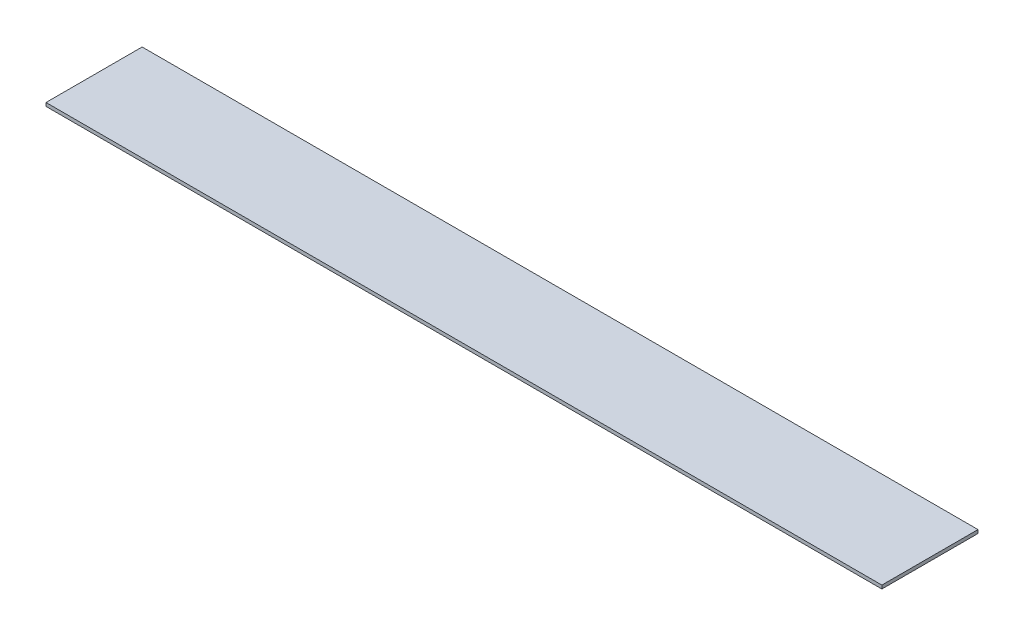
ISO-10303-21;
HEADER;
FILE_DESCRIPTION(('STEP AP214'),'2;1');
FILE_NAME('part.step','',(''),(''),'','','');
FILE_SCHEMA(('AUTOMOTIVE_DESIGN { 1 0 10303 214 1 1 1 1 }'));
ENDSEC;
DATA;
#1=APPLICATION_CONTEXT('core data for automotive mechanical design processes');
#2=APPLICATION_PROTOCOL_DEFINITION('international standard','automotive_design',2000,#1);
#3=PRODUCT_CONTEXT('',#1,'mechanical');
#4=PRODUCT('Part','Part','',(#3));
#5=PRODUCT_RELATED_PRODUCT_CATEGORY('part','',(#4));
#6=PRODUCT_DEFINITION_FORMATION('','',#4);
#7=PRODUCT_DEFINITION_CONTEXT('part definition',#1,'design');
#8=PRODUCT_DEFINITION('design','',#6,#7);
#9=PRODUCT_DEFINITION_SHAPE('','',#8);
#10=(LENGTH_UNIT() NAMED_UNIT(*) SI_UNIT(.MILLI.,.METRE.));
#11=(NAMED_UNIT(*) PLANE_ANGLE_UNIT() SI_UNIT($,.RADIAN.));
#12=(NAMED_UNIT(*) SI_UNIT($,.STERADIAN.) SOLID_ANGLE_UNIT());
#13=UNCERTAINTY_MEASURE_WITH_UNIT(LENGTH_MEASURE(1.E-05),#10,'distance_accuracy_value','');
#14=(GEOMETRIC_REPRESENTATION_CONTEXT(3) GLOBAL_UNCERTAINTY_ASSIGNED_CONTEXT((#13)) GLOBAL_UNIT_ASSIGNED_CONTEXT((#10,
#11,#12)) REPRESENTATION_CONTEXT('',''));
#15=CARTESIAN_POINT('',(0.,0.,0.));
#16=DIRECTION('',(0.,0.,1.));
#17=DIRECTION('',(1.,0.,0.));
#18=AXIS2_PLACEMENT_3D('',#15,#16,#17);
#19=CARTESIAN_POINT('',(1209.75080176924,1396.06710603682,1121.25455636952));
#20=DIRECTION('',(-1.,0.,0.));
#21=DIRECTION('',(0.,0.,1.));
#22=AXIS2_PLACEMENT_3D('',#19,#20,#21);
#23=PLANE('',#22);
#24=DIRECTION('',(0.,0.,1.));
#25=VECTOR('',#24,1.);
#26=CARTESIAN_POINT('',(1209.75080176924,1402.41710603682,1121.25455636952));
#27=LINE('',#26,#25);
#28=CARTESIAN_POINT('',(1209.75080176924,1402.41710603682,943.454556369515));
#29=VERTEX_POINT('',#28);
#30=CARTESIAN_POINT('',(1209.75080176924,1402.41710603682,1121.25455636952));
#31=VERTEX_POINT('',#30);
#32=EDGE_CURVE('E96',#29,#31,#27,.T.);
#33=ORIENTED_EDGE('',*,*,#32,.T.);
#34=DIRECTION('',(0.,1.,0.));
#35=VECTOR('',#34,1.);
#36=CARTESIAN_POINT('',(1209.75080176924,1396.06710603682,1121.25455636952));
#37=LINE('',#36,#35);
#38=CARTESIAN_POINT('',(1209.75080176924,1396.06710603682,1121.25455636952));
#39=VERTEX_POINT('',#38);
#40=EDGE_CURVE('E11',#39,#31,#37,.T.);
#41=ORIENTED_EDGE('',*,*,#40,.F.);
#42=DIRECTION('',(0.,0.,1.));
#43=VECTOR('',#42,1.);
#44=CARTESIAN_POINT('',(1209.75080176924,1396.06710603682,1121.25455636952));
#45=LINE('',#44,#43);
#46=CARTESIAN_POINT('',(1209.75080176924,1396.06710603682,943.454556369515));
#47=VERTEX_POINT('',#46);
#48=EDGE_CURVE('E84',#47,#39,#45,.T.);
#49=ORIENTED_EDGE('',*,*,#48,.F.);
#50=DIRECTION('',(0.,1.,0.));
#51=VECTOR('',#50,1.);
#52=CARTESIAN_POINT('',(1209.75080176924,1396.06710603682,943.454556369515));
#53=LINE('',#52,#51);
#54=EDGE_CURVE('E92',#47,#29,#53,.T.);
#55=ORIENTED_EDGE('',*,*,#54,.T.);
#56=EDGE_LOOP('',(#33,#41,#49,#55));
#57=FACE_BOUND('',#56,.T.);
#58=ADVANCED_FACE('F33',(#57),#23,.F.);
#59=CARTESIAN_POINT('',(1209.75080176924,1396.06710603682,1121.25455636952));
#60=DIRECTION('',(0.,0.,-1.));
#61=DIRECTION('',(-1.,0.,0.));
#62=AXIS2_PLACEMENT_3D('',#59,#60,#61);
#63=PLANE('',#62);
#64=DIRECTION('',(-1.,0.,0.));
#65=VECTOR('',#64,1.);
#66=CARTESIAN_POINT('',(1209.75080176924,1402.41710603682,1121.25455636952));
#67=LINE('',#66,#65);
#68=CARTESIAN_POINT('',(-336.146804180864,1402.41710603682,1121.25455636952));
#69=VERTEX_POINT('',#68);
#70=EDGE_CURVE('E88',#31,#69,#67,.T.);
#71=ORIENTED_EDGE('',*,*,#70,.T.);
#72=DIRECTION('',(0.,1.,0.));
#73=VECTOR('',#72,1.);
#74=CARTESIAN_POINT('',(-336.146804180864,1396.06710603682,1121.25455636952));
#75=LINE('',#74,#73);
#76=CARTESIAN_POINT('',(-336.146804180864,1396.06710603682,1121.25455636952));
#77=VERTEX_POINT('',#76);
#78=EDGE_CURVE('E41',#77,#69,#75,.T.);
#79=ORIENTED_EDGE('',*,*,#78,.F.);
#80=DIRECTION('',(-1.,0.,0.));
#81=VECTOR('',#80,1.);
#82=CARTESIAN_POINT('',(1209.75080176924,1396.06710603682,1121.25455636952));
#83=LINE('',#82,#81);
#84=EDGE_CURVE('E79',#39,#77,#83,.T.);
#85=ORIENTED_EDGE('',*,*,#84,.F.);
#86=ORIENTED_EDGE('',*,*,#40,.T.);
#87=EDGE_LOOP('',(#71,#79,#85,#86));
#88=FACE_BOUND('',#87,.T.);
#89=ADVANCED_FACE('F87',(#88),#63,.F.);
#90=CARTESIAN_POINT('',(-336.146804180864,1396.06710603682,1121.25455636952));
#91=DIRECTION('',(1.,0.,0.));
#92=DIRECTION('',(0.,0.,-1.));
#93=AXIS2_PLACEMENT_3D('',#90,#91,#92);
#94=PLANE('',#93);
#95=DIRECTION('',(0.,0.,-1.));
#96=VECTOR('',#95,1.);
#97=CARTESIAN_POINT('',(-336.146804180864,1402.41710603682,1121.25455636952));
#98=LINE('',#97,#96);
#99=CARTESIAN_POINT('',(-336.146804180864,1402.41710603682,943.454556369515));
#100=VERTEX_POINT('',#99);
#101=EDGE_CURVE('E66',#69,#100,#98,.T.);
#102=ORIENTED_EDGE('',*,*,#101,.T.);
#103=DIRECTION('',(0.,1.,0.));
#104=VECTOR('',#103,1.);
#105=CARTESIAN_POINT('',(-336.146804180864,1396.06710603682,943.454556369515));
#106=LINE('',#105,#104);
#107=CARTESIAN_POINT('',(-336.146804180864,1396.06710603682,943.454556369515));
#108=VERTEX_POINT('',#107);
#109=EDGE_CURVE('E89',#108,#100,#106,.T.);
#110=ORIENTED_EDGE('',*,*,#109,.F.);
#111=DIRECTION('',(0.,0.,-1.));
#112=VECTOR('',#111,1.);
#113=CARTESIAN_POINT('',(-336.146804180864,1396.06710603682,1121.25455636952));
#114=LINE('',#113,#112);
#115=EDGE_CURVE('E82',#77,#108,#114,.T.);
#116=ORIENTED_EDGE('',*,*,#115,.F.);
#117=ORIENTED_EDGE('',*,*,#78,.T.);
#118=EDGE_LOOP('',(#102,#110,#116,#117));
#119=FACE_BOUND('',#118,.T.);
#120=ADVANCED_FACE('F90',(#119),#94,.F.);
#121=CARTESIAN_POINT('',(1209.75080176924,1396.06710603682,943.454556369515));
#122=DIRECTION('',(0.,0.,1.));
#123=DIRECTION('',(1.,0.,0.));
#124=AXIS2_PLACEMENT_3D('',#121,#122,#123);
#125=PLANE('',#124);
#126=DIRECTION('',(1.,0.,0.));
#127=VECTOR('',#126,1.);
#128=CARTESIAN_POINT('',(1209.75080176924,1402.41710603682,943.454556369515));
#129=LINE('',#128,#127);
#130=EDGE_CURVE('E72',#100,#29,#129,.T.);
#131=ORIENTED_EDGE('',*,*,#130,.T.);
#132=ORIENTED_EDGE('',*,*,#54,.F.);
#133=DIRECTION('',(1.,0.,0.));
#134=VECTOR('',#133,1.);
#135=CARTESIAN_POINT('',(1209.75080176924,1396.06710603682,943.454556369515));
#136=LINE('',#135,#134);
#137=EDGE_CURVE('E49',#108,#47,#136,.T.);
#138=ORIENTED_EDGE('',*,*,#137,.F.);
#139=ORIENTED_EDGE('',*,*,#109,.T.);
#140=EDGE_LOOP('',(#131,#132,#138,#139));
#141=FACE_BOUND('',#140,.T.);
#142=ADVANCED_FACE('F103',(#141),#125,.F.);
#143=CARTESIAN_POINT('',(0.,1396.06710603682,0.));
#144=DIRECTION('',(0.,1.,0.));
#145=DIRECTION('',(0.,0.,1.));
#146=AXIS2_PLACEMENT_3D('',#143,#144,#145);
#147=PLANE('',#146);
#148=ORIENTED_EDGE('',*,*,#48,.T.);
#149=ORIENTED_EDGE('',*,*,#84,.T.);
#150=ORIENTED_EDGE('',*,*,#115,.T.);
#151=ORIENTED_EDGE('',*,*,#137,.T.);
#152=EDGE_LOOP('',(#148,#149,#150,#151));
#153=FACE_BOUND('',#152,.T.);
#154=ADVANCED_FACE('F80',(#153),#147,.F.);
#155=CARTESIAN_POINT('',(0.,1402.41710603682,0.));
#156=DIRECTION('',(0.,1.,0.));
#157=DIRECTION('',(0.,0.,1.));
#158=AXIS2_PLACEMENT_3D('',#155,#156,#157);
#159=PLANE('',#158);
#160=ORIENTED_EDGE('',*,*,#32,.F.);
#161=ORIENTED_EDGE('',*,*,#130,.F.);
#162=ORIENTED_EDGE('',*,*,#101,.F.);
#163=ORIENTED_EDGE('',*,*,#70,.F.);
#164=EDGE_LOOP('',(#160,#161,#162,#163));
#165=FACE_BOUND('',#164,.T.);
#166=ADVANCED_FACE('F106',(#165),#159,.T.);
#167=CLOSED_SHELL('',(#58,#89,#120,#142,#154,#166));
#168=MANIFOLD_SOLID_BREP('B2',#167);
#169=ADVANCED_BREP_SHAPE_REPRESENTATION('',(#18,#168),#14);
#170=SHAPE_DEFINITION_REPRESENTATION(#9,#169);
ENDSEC;
END-ISO-10303-21;
